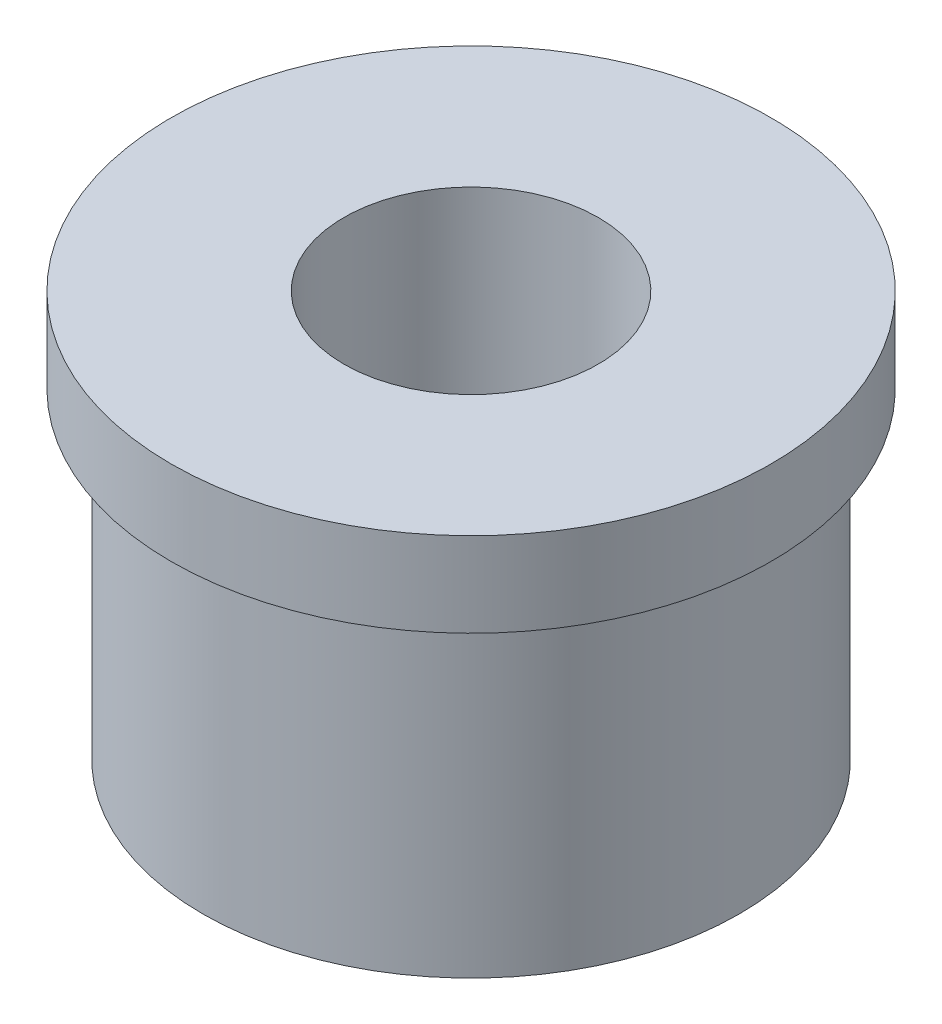
ISO-10303-21;
HEADER;
FILE_DESCRIPTION(('STEP AP214'),'2;1');
FILE_NAME('part.step','',(''),(''),'','','');
FILE_SCHEMA(('AUTOMOTIVE_DESIGN { 1 0 10303 214 1 1 1 1 }'));
ENDSEC;
DATA;
#1=APPLICATION_CONTEXT('core data for automotive mechanical design processes');
#2=APPLICATION_PROTOCOL_DEFINITION('international standard','automotive_design',2000,#1);
#3=PRODUCT_CONTEXT('',#1,'mechanical');
#4=PRODUCT('Part','Part','',(#3));
#5=PRODUCT_RELATED_PRODUCT_CATEGORY('part','',(#4));
#6=PRODUCT_DEFINITION_FORMATION('','',#4);
#7=PRODUCT_DEFINITION_CONTEXT('part definition',#1,'design');
#8=PRODUCT_DEFINITION('design','',#6,#7);
#9=PRODUCT_DEFINITION_SHAPE('','',#8);
#10=(LENGTH_UNIT() NAMED_UNIT(*) SI_UNIT(.MILLI.,.METRE.));
#11=(NAMED_UNIT(*) PLANE_ANGLE_UNIT() SI_UNIT($,.RADIAN.));
#12=(NAMED_UNIT(*) SI_UNIT($,.STERADIAN.) SOLID_ANGLE_UNIT());
#13=UNCERTAINTY_MEASURE_WITH_UNIT(LENGTH_MEASURE(1.E-05),#10,'distance_accuracy_value','');
#14=(GEOMETRIC_REPRESENTATION_CONTEXT(3) GLOBAL_UNCERTAINTY_ASSIGNED_CONTEXT((#13)) GLOBAL_UNIT_ASSIGNED_CONTEXT((#10,
#11,#12)) REPRESENTATION_CONTEXT('',''));
#15=CARTESIAN_POINT('',(0.,0.,0.));
#16=DIRECTION('',(0.,0.,1.));
#17=DIRECTION('',(1.,0.,0.));
#18=AXIS2_PLACEMENT_3D('',#15,#16,#17);
#19=CARTESIAN_POINT('',(0.,9.6,0.));
#20=DIRECTION('',(0.,-1.,0.));
#21=DIRECTION('',(0.,0.,-1.));
#22=AXIS2_PLACEMENT_3D('',#19,#20,#21);
#23=CYLINDRICAL_SURFACE('',#22,6.35);
#24=CARTESIAN_POINT('',(0.,0.,0.));
#25=DIRECTION('',(0.,1.,0.));
#26=DIRECTION('',(0.,0.,1.));
#27=AXIS2_PLACEMENT_3D('',#24,#25,#26);
#28=CIRCLE('',#27,6.35);
#29=CARTESIAN_POINT('',(0.,0.,6.35));
#30=VERTEX_POINT('',#29);
#31=EDGE_CURVE('E34',#30,#30,#28,.T.);
#32=ORIENTED_EDGE('',*,*,#31,.T.);
#33=EDGE_LOOP('',(#32));
#34=FACE_BOUND('',#33,.T.);
#35=CARTESIAN_POINT('',(0.,7.6,0.));
#36=DIRECTION('',(0.,1.,0.));
#37=DIRECTION('',(0.,0.,1.));
#38=AXIS2_PLACEMENT_3D('',#35,#36,#37);
#39=CIRCLE('',#38,6.35);
#40=CARTESIAN_POINT('',(0.,7.6,6.35));
#41=VERTEX_POINT('',#40);
#42=EDGE_CURVE('E10',#41,#41,#39,.T.);
#43=ORIENTED_EDGE('',*,*,#42,.F.);
#44=EDGE_LOOP('',(#43));
#45=FACE_BOUND('',#44,.T.);
#46=ADVANCED_FACE('F28',(#34,#45),#23,.T.);
#47=CARTESIAN_POINT('',(0.,9.6,0.));
#48=DIRECTION('',(0.,1.,0.));
#49=DIRECTION('',(0.,0.,1.));
#50=AXIS2_PLACEMENT_3D('',#47,#48,#49);
#51=PLANE('',#50);
#52=CARTESIAN_POINT('',(0.,9.6,0.));
#53=DIRECTION('',(0.,1.,0.));
#54=DIRECTION('',(0.,0.,1.));
#55=AXIS2_PLACEMENT_3D('',#52,#53,#54);
#56=CIRCLE('',#55,7.1);
#57=CARTESIAN_POINT('',(0.,9.6,7.1));
#58=VERTEX_POINT('',#57);
#59=EDGE_CURVE('E48',#58,#58,#56,.T.);
#60=ORIENTED_EDGE('',*,*,#59,.T.);
#61=EDGE_LOOP('',(#60));
#62=FACE_BOUND('',#61,.T.);
#63=CARTESIAN_POINT('',(0.,9.6,0.));
#64=DIRECTION('',(0.,1.,0.));
#65=DIRECTION('',(0.,0.,1.));
#66=AXIS2_PLACEMENT_3D('',#63,#64,#65);
#67=CIRCLE('',#66,3.01);
#68=CARTESIAN_POINT('',(0.,9.6,3.01));
#69=VERTEX_POINT('',#68);
#70=EDGE_CURVE('E38',#69,#69,#67,.T.);
#71=ORIENTED_EDGE('',*,*,#70,.F.);
#72=EDGE_LOOP('',(#71));
#73=FACE_BOUND('',#72,.T.);
#74=ADVANCED_FACE('F70',(#62,#73),#51,.T.);
#75=CARTESIAN_POINT('',(0.,0.,0.));
#76=DIRECTION('',(0.,1.,0.));
#77=DIRECTION('',(0.,0.,1.));
#78=AXIS2_PLACEMENT_3D('',#75,#76,#77);
#79=PLANE('',#78);
#80=ORIENTED_EDGE('',*,*,#31,.F.);
#81=EDGE_LOOP('',(#80));
#82=FACE_BOUND('',#81,.T.);
#83=CARTESIAN_POINT('',(0.,0.,0.));
#84=DIRECTION('',(0.,1.,0.));
#85=DIRECTION('',(0.,0.,1.));
#86=AXIS2_PLACEMENT_3D('',#83,#84,#85);
#87=CIRCLE('',#86,3.01);
#88=CARTESIAN_POINT('',(0.,0.,3.01));
#89=VERTEX_POINT('',#88);
#90=EDGE_CURVE('E42',#89,#89,#87,.T.);
#91=ORIENTED_EDGE('',*,*,#90,.T.);
#92=EDGE_LOOP('',(#91));
#93=FACE_BOUND('',#92,.T.);
#94=ADVANCED_FACE('F66',(#82,#93),#79,.F.);
#95=CARTESIAN_POINT('',(0.,9.6,0.));
#96=DIRECTION('',(0.,-1.,0.));
#97=DIRECTION('',(0.,0.,-1.));
#98=AXIS2_PLACEMENT_3D('',#95,#96,#97);
#99=CYLINDRICAL_SURFACE('',#98,3.01);
#100=ORIENTED_EDGE('',*,*,#70,.T.);
#101=EDGE_LOOP('',(#100));
#102=FACE_BOUND('',#101,.T.);
#103=ORIENTED_EDGE('',*,*,#90,.F.);
#104=EDGE_LOOP('',(#103));
#105=FACE_BOUND('',#104,.T.);
#106=ADVANCED_FACE('F59',(#102,#105),#99,.F.);
#107=CARTESIAN_POINT('',(0.,7.6,0.));
#108=DIRECTION('',(0.,1.,0.));
#109=DIRECTION('',(0.,0.,1.));
#110=AXIS2_PLACEMENT_3D('',#107,#108,#109);
#111=PLANE('',#110);
#112=CARTESIAN_POINT('',(0.,7.6,0.));
#113=DIRECTION('',(0.,1.,0.));
#114=DIRECTION('',(0.,0.,1.));
#115=AXIS2_PLACEMENT_3D('',#112,#113,#114);
#116=CIRCLE('',#115,7.1);
#117=CARTESIAN_POINT('',(0.,7.6,7.1));
#118=VERTEX_POINT('',#117);
#119=EDGE_CURVE('E46',#118,#118,#116,.T.);
#120=ORIENTED_EDGE('',*,*,#119,.F.);
#121=EDGE_LOOP('',(#120));
#122=FACE_BOUND('',#121,.T.);
#123=ORIENTED_EDGE('',*,*,#42,.T.);
#124=EDGE_LOOP('',(#123));
#125=FACE_BOUND('',#124,.T.);
#126=ADVANCED_FACE('F57',(#122,#125),#111,.F.);
#127=CARTESIAN_POINT('',(0.,7.6,0.));
#128=DIRECTION('',(0.,1.,0.));
#129=DIRECTION('',(0.,0.,1.));
#130=AXIS2_PLACEMENT_3D('',#127,#128,#129);
#131=CYLINDRICAL_SURFACE('',#130,7.1);
#132=ORIENTED_EDGE('',*,*,#119,.T.);
#133=EDGE_LOOP('',(#132));
#134=FACE_BOUND('',#133,.T.);
#135=ORIENTED_EDGE('',*,*,#59,.F.);
#136=EDGE_LOOP('',(#135));
#137=FACE_BOUND('',#136,.T.);
#138=ADVANCED_FACE('F54',(#134,#137),#131,.T.);
#139=CLOSED_SHELL('',(#46,#74,#94,#106,#126,#138));
#140=MANIFOLD_SOLID_BREP('B2',#139);
#141=ADVANCED_BREP_SHAPE_REPRESENTATION('',(#18,#140),#14);
#142=SHAPE_DEFINITION_REPRESENTATION(#9,#141);
ENDSEC;
END-ISO-10303-21;
